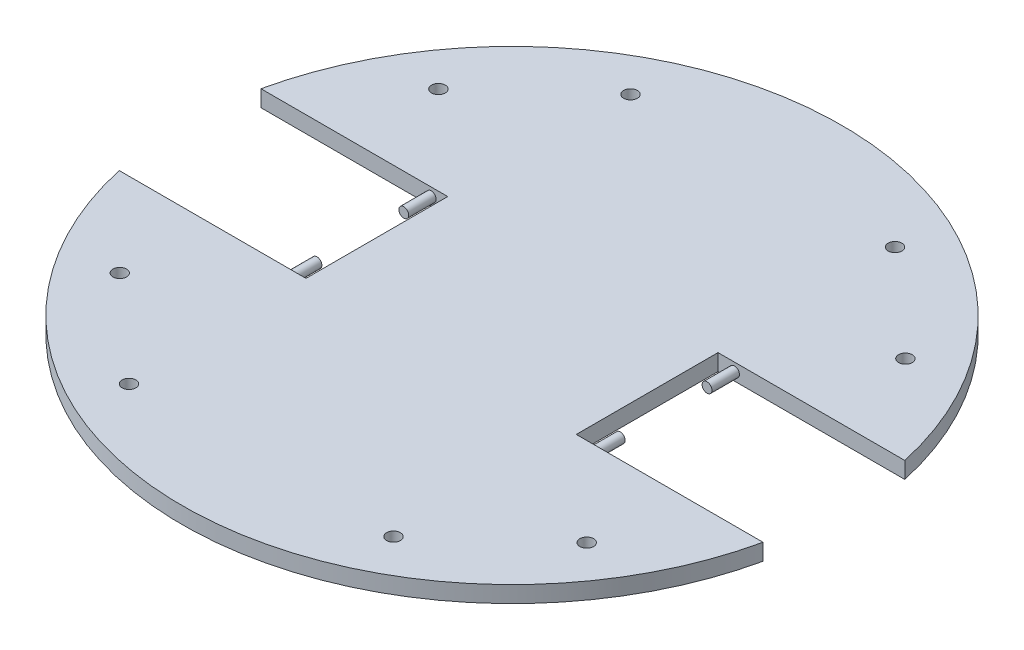
ISO-10303-21;
HEADER;
FILE_DESCRIPTION(('STEP AP214'),'2;1');
FILE_NAME('part.step','',(''),(''),'','','');
FILE_SCHEMA(('AUTOMOTIVE_DESIGN { 1 0 10303 214 1 1 1 1 }'));
ENDSEC;
DATA;
#1=APPLICATION_CONTEXT('core data for automotive mechanical design processes');
#2=APPLICATION_PROTOCOL_DEFINITION('international standard','automotive_design',2000,#1);
#3=PRODUCT_CONTEXT('',#1,'mechanical');
#4=PRODUCT('Part','Part','',(#3));
#5=PRODUCT_RELATED_PRODUCT_CATEGORY('part','',(#4));
#6=PRODUCT_DEFINITION_FORMATION('','',#4);
#7=PRODUCT_DEFINITION_CONTEXT('part definition',#1,'design');
#8=PRODUCT_DEFINITION('design','',#6,#7);
#9=PRODUCT_DEFINITION_SHAPE('','',#8);
#10=(LENGTH_UNIT() NAMED_UNIT(*) SI_UNIT(.MILLI.,.METRE.));
#11=(NAMED_UNIT(*) PLANE_ANGLE_UNIT() SI_UNIT($,.RADIAN.));
#12=(NAMED_UNIT(*) SI_UNIT($,.STERADIAN.) SOLID_ANGLE_UNIT());
#13=UNCERTAINTY_MEASURE_WITH_UNIT(LENGTH_MEASURE(1.E-05),#10,'distance_accuracy_value','');
#14=(GEOMETRIC_REPRESENTATION_CONTEXT(3) GLOBAL_UNCERTAINTY_ASSIGNED_CONTEXT((#13)) GLOBAL_UNIT_ASSIGNED_CONTEXT((#10,
#11,#12)) REPRESENTATION_CONTEXT('',''));
#15=CARTESIAN_POINT('',(0.,0.,0.));
#16=DIRECTION('',(0.,0.,1.));
#17=DIRECTION('',(1.,0.,0.));
#18=AXIS2_PLACEMENT_3D('',#15,#16,#17);
#19=CARTESIAN_POINT('',(0.,3.,0.));
#20=DIRECTION('',(0.,-1.,0.));
#21=DIRECTION('',(0.,0.,-1.));
#22=AXIS2_PLACEMENT_3D('',#19,#20,#21);
#23=CYLINDRICAL_SURFACE('',#22,60.);
#24=DIRECTION('',(0.,1.,0.));
#25=VECTOR('',#24,1.);
#26=CARTESIAN_POINT('',(-58.5968429183689,0.,12.9));
#27=LINE('',#26,#25);
#28=CARTESIAN_POINT('',(-58.5968429183689,0.,12.9));
#29=VERTEX_POINT('',#28);
#30=CARTESIAN_POINT('',(-58.5968429183689,3.,12.9));
#31=VERTEX_POINT('',#30);
#32=EDGE_CURVE('E135',#29,#31,#27,.T.);
#33=ORIENTED_EDGE('',*,*,#32,.F.);
#34=CARTESIAN_POINT('',(0.,0.,0.));
#35=DIRECTION('',(0.,1.,0.));
#36=DIRECTION('',(0.,0.,1.));
#37=AXIS2_PLACEMENT_3D('',#34,#35,#36);
#38=CIRCLE('',#37,60.);
#39=CARTESIAN_POINT('',(58.5968429183689,0.,12.9));
#40=VERTEX_POINT('',#39);
#41=EDGE_CURVE('E205',#29,#40,#38,.T.);
#42=ORIENTED_EDGE('',*,*,#41,.T.);
#43=DIRECTION('',(0.,1.,0.));
#44=VECTOR('',#43,1.);
#45=CARTESIAN_POINT('',(58.5968429183689,0.,12.9));
#46=LINE('',#45,#44);
#47=CARTESIAN_POINT('',(58.5968429183689,3.,12.9));
#48=VERTEX_POINT('',#47);
#49=EDGE_CURVE('E56',#40,#48,#46,.T.);
#50=ORIENTED_EDGE('',*,*,#49,.T.);
#51=CARTESIAN_POINT('',(0.,3.,0.));
#52=DIRECTION('',(0.,1.,0.));
#53=DIRECTION('',(0.,0.,1.));
#54=AXIS2_PLACEMENT_3D('',#51,#52,#53);
#55=CIRCLE('',#54,60.);
#56=EDGE_CURVE('E208',#31,#48,#55,.T.);
#57=ORIENTED_EDGE('',*,*,#56,.F.);
#58=EDGE_LOOP('',(#33,#42,#50,#57));
#59=FACE_BOUND('',#58,.T.);
#60=ADVANCED_FACE('F34',(#59),#23,.T.);
#61=CARTESIAN_POINT('',(58.5968429183689,0.,-12.9));
#62=VERTEX_POINT('',#61);
#63=CARTESIAN_POINT('',(-58.5968429183689,0.,-12.9));
#64=VERTEX_POINT('',#63);
#65=EDGE_CURVE('E212',#62,#64,#38,.T.);
#66=ORIENTED_EDGE('',*,*,#65,.T.);
#67=DIRECTION('',(0.,1.,0.));
#68=VECTOR('',#67,1.);
#69=CARTESIAN_POINT('',(-58.5968429183689,0.,-12.9));
#70=LINE('',#69,#68);
#71=CARTESIAN_POINT('',(-58.5968429183689,3.,-12.9));
#72=VERTEX_POINT('',#71);
#73=EDGE_CURVE('E48',#64,#72,#70,.T.);
#74=ORIENTED_EDGE('',*,*,#73,.T.);
#75=CARTESIAN_POINT('',(58.5968429183689,3.,-12.9));
#76=VERTEX_POINT('',#75);
#77=EDGE_CURVE('E211',#76,#72,#55,.T.);
#78=ORIENTED_EDGE('',*,*,#77,.F.);
#79=DIRECTION('',(0.,1.,0.));
#80=VECTOR('',#79,1.);
#81=CARTESIAN_POINT('',(58.5968429183689,0.,-12.9));
#82=LINE('',#81,#80);
#83=EDGE_CURVE('E156',#62,#76,#82,.T.);
#84=ORIENTED_EDGE('',*,*,#83,.F.);
#85=EDGE_LOOP('',(#66,#74,#78,#84));
#86=FACE_BOUND('',#85,.T.);
#87=ADVANCED_FACE('F225',(#86),#23,.T.);
#88=CARTESIAN_POINT('',(0.,3.,0.));
#89=DIRECTION('',(0.,1.,0.));
#90=DIRECTION('',(0.,0.,1.));
#91=AXIS2_PLACEMENT_3D('',#88,#89,#90);
#92=PLANE('',#91);
#93=CARTESIAN_POINT('',(42.6064496423327,3.,-29.0020858945053));
#94=DIRECTION('',(0.,1.,0.));
#95=DIRECTION('',(0.,0.,1.));
#96=AXIS2_PLACEMENT_3D('',#93,#94,#95);
#97=CIRCLE('',#96,1.25);
#98=CARTESIAN_POINT('',(42.6064496423327,3.,-27.7520858945053));
#99=VERTEX_POINT('',#98);
#100=EDGE_CURVE('E182',#99,#99,#97,.T.);
#101=ORIENTED_EDGE('',*,*,#100,.F.);
#102=EDGE_LOOP('',(#101));
#103=FACE_BOUND('',#102,.T.);
#104=CARTESIAN_POINT('',(42.6064496423327,3.,29.0020858945053));
#105=DIRECTION('',(0.,1.,0.));
#106=DIRECTION('',(0.,0.,-1.));
#107=AXIS2_PLACEMENT_3D('',#104,#105,#106);
#108=CIRCLE('',#107,1.25);
#109=CARTESIAN_POINT('',(42.6064496423327,3.,27.7520858945053));
#110=VERTEX_POINT('',#109);
#111=EDGE_CURVE('E188',#110,#110,#108,.T.);
#112=ORIENTED_EDGE('',*,*,#111,.F.);
#113=EDGE_LOOP('',(#112));
#114=FACE_BOUND('',#113,.T.);
#115=CARTESIAN_POINT('',(-42.3935503576673,3.,29.0020858945053));
#116=DIRECTION('',(0.,1.,0.));
#117=DIRECTION('',(0.,0.,-1.));
#118=AXIS2_PLACEMENT_3D('',#115,#116,#117);
#119=CIRCLE('',#118,1.25);
#120=CARTESIAN_POINT('',(-42.3935503576673,3.,27.7520858945053));
#121=VERTEX_POINT('',#120);
#122=EDGE_CURVE('E194',#121,#121,#119,.T.);
#123=ORIENTED_EDGE('',*,*,#122,.F.);
#124=EDGE_LOOP('',(#123));
#125=FACE_BOUND('',#124,.T.);
#126=CARTESIAN_POINT('',(-24.0731025072115,3.,-45.6446312019142));
#127=DIRECTION('',(0.,1.,0.));
#128=DIRECTION('',(0.,0.,1.));
#129=AXIS2_PLACEMENT_3D('',#126,#127,#128);
#130=CIRCLE('',#129,1.25);
#131=CARTESIAN_POINT('',(-24.0731025072115,3.,-44.3946312019142));
#132=VERTEX_POINT('',#131);
#133=EDGE_CURVE('E163',#132,#132,#130,.T.);
#134=ORIENTED_EDGE('',*,*,#133,.F.);
#135=EDGE_LOOP('',(#134));
#136=FACE_BOUND('',#135,.T.);
#137=CARTESIAN_POINT('',(24.0731025072115,3.,-45.6446312019142));
#138=DIRECTION('',(0.,1.,0.));
#139=DIRECTION('',(0.,0.,-1.));
#140=AXIS2_PLACEMENT_3D('',#137,#138,#139);
#141=CIRCLE('',#140,1.25);
#142=CARTESIAN_POINT('',(24.0731025072115,3.,-46.8946312019142));
#143=VERTEX_POINT('',#142);
#144=EDGE_CURVE('E164',#143,#143,#141,.T.);
#145=ORIENTED_EDGE('',*,*,#144,.F.);
#146=EDGE_LOOP('',(#145));
#147=FACE_BOUND('',#146,.T.);
#148=CARTESIAN_POINT('',(24.0731025072115,3.,45.6446312019142));
#149=DIRECTION('',(0.,1.,0.));
#150=DIRECTION('',(0.,0.,1.));
#151=AXIS2_PLACEMENT_3D('',#148,#149,#150);
#152=CIRCLE('',#151,1.25);
#153=CARTESIAN_POINT('',(24.0731025072115,3.,46.8946312019142));
#154=VERTEX_POINT('',#153);
#155=EDGE_CURVE('E170',#154,#154,#152,.T.);
#156=ORIENTED_EDGE('',*,*,#155,.F.);
#157=EDGE_LOOP('',(#156));
#158=FACE_BOUND('',#157,.T.);
#159=CARTESIAN_POINT('',(-24.0731025072115,3.,45.6446312019142));
#160=DIRECTION('',(0.,1.,0.));
#161=DIRECTION('',(0.,0.,-1.));
#162=AXIS2_PLACEMENT_3D('',#159,#160,#161);
#163=CIRCLE('',#162,1.25);
#164=CARTESIAN_POINT('',(-24.0731025072115,3.,44.3946312019142));
#165=VERTEX_POINT('',#164);
#166=EDGE_CURVE('E134',#165,#165,#163,.T.);
#167=ORIENTED_EDGE('',*,*,#166,.F.);
#168=EDGE_LOOP('',(#167));
#169=FACE_BOUND('',#168,.T.);
#170=CARTESIAN_POINT('',(-42.3935503576673,3.,-29.0020858945053));
#171=DIRECTION('',(0.,1.,0.));
#172=DIRECTION('',(0.,0.,1.));
#173=AXIS2_PLACEMENT_3D('',#170,#171,#172);
#174=CIRCLE('',#173,1.25);
#175=CARTESIAN_POINT('',(-42.3935503576673,3.,-27.7520858945053));
#176=VERTEX_POINT('',#175);
#177=EDGE_CURVE('E181',#176,#176,#174,.T.);
#178=ORIENTED_EDGE('',*,*,#177,.F.);
#179=EDGE_LOOP('',(#178));
#180=FACE_BOUND('',#179,.T.);
#181=DIRECTION('',(0.,0.,1.));
#182=VECTOR('',#181,1.);
#183=CARTESIAN_POINT('',(-24.6,3.,0.));
#184=LINE('',#183,#182);
#185=CARTESIAN_POINT('',(-24.6,3.,-12.9));
#186=VERTEX_POINT('',#185);
#187=CARTESIAN_POINT('',(-24.6,3.,12.9));
#188=VERTEX_POINT('',#187);
#189=EDGE_CURVE('E106',#186,#188,#184,.T.);
#190=ORIENTED_EDGE('',*,*,#189,.T.);
#191=DIRECTION('',(-1.,0.,0.));
#192=VECTOR('',#191,1.);
#193=CARTESIAN_POINT('',(0.,3.,12.9));
#194=LINE('',#193,#192);
#195=EDGE_CURVE('E119',#188,#31,#194,.T.);
#196=ORIENTED_EDGE('',*,*,#195,.T.);
#197=ORIENTED_EDGE('',*,*,#56,.T.);
#198=DIRECTION('',(1.,0.,0.));
#199=VECTOR('',#198,1.);
#200=CARTESIAN_POINT('',(0.,3.,12.9));
#201=LINE('',#200,#199);
#202=CARTESIAN_POINT('',(24.6,3.,12.9));
#203=VERTEX_POINT('',#202);
#204=EDGE_CURVE('E150',#203,#48,#201,.T.);
#205=ORIENTED_EDGE('',*,*,#204,.F.);
#206=DIRECTION('',(0.,0.,1.));
#207=VECTOR('',#206,1.);
#208=CARTESIAN_POINT('',(24.6,3.,0.));
#209=LINE('',#208,#207);
#210=CARTESIAN_POINT('',(24.6,3.,-12.9));
#211=VERTEX_POINT('',#210);
#212=EDGE_CURVE('E147',#211,#203,#209,.T.);
#213=ORIENTED_EDGE('',*,*,#212,.F.);
#214=DIRECTION('',(1.,0.,0.));
#215=VECTOR('',#214,1.);
#216=CARTESIAN_POINT('',(0.,3.,-12.9));
#217=LINE('',#216,#215);
#218=EDGE_CURVE('E142',#211,#76,#217,.T.);
#219=ORIENTED_EDGE('',*,*,#218,.T.);
#220=ORIENTED_EDGE('',*,*,#77,.T.);
#221=DIRECTION('',(-1.,0.,0.));
#222=VECTOR('',#221,1.);
#223=CARTESIAN_POINT('',(0.,3.,-12.9));
#224=LINE('',#223,#222);
#225=EDGE_CURVE('E122',#186,#72,#224,.T.);
#226=ORIENTED_EDGE('',*,*,#225,.F.);
#227=EDGE_LOOP('',(#190,#196,#197,#205,#213,#219,#220,#226));
#228=FACE_BOUND('',#227,.T.);
#229=ADVANCED_FACE('F220',(#103,#114,#125,#136,#147,#158,#169,#180,#228),#92,.T.);
#230=CARTESIAN_POINT('',(0.,0.,0.));
#231=DIRECTION('',(0.,1.,0.));
#232=DIRECTION('',(0.,0.,1.));
#233=AXIS2_PLACEMENT_3D('',#230,#231,#232);
#234=PLANE('',#233);
#235=CARTESIAN_POINT('',(42.6064496423327,0.,-29.0020858945053));
#236=DIRECTION('',(0.,1.,0.));
#237=DIRECTION('',(0.,0.,1.));
#238=AXIS2_PLACEMENT_3D('',#235,#236,#237);
#239=CIRCLE('',#238,1.25);
#240=CARTESIAN_POINT('',(42.6064496423327,0.,-27.7520858945053));
#241=VERTEX_POINT('',#240);
#242=EDGE_CURVE('E178',#241,#241,#239,.T.);
#243=ORIENTED_EDGE('',*,*,#242,.T.);
#244=EDGE_LOOP('',(#243));
#245=FACE_BOUND('',#244,.T.);
#246=CARTESIAN_POINT('',(42.6064496423327,0.,29.0020858945053));
#247=DIRECTION('',(0.,1.,0.));
#248=DIRECTION('',(0.,0.,-1.));
#249=AXIS2_PLACEMENT_3D('',#246,#247,#248);
#250=CIRCLE('',#249,1.25);
#251=CARTESIAN_POINT('',(42.6064496423327,0.,27.7520858945053));
#252=VERTEX_POINT('',#251);
#253=EDGE_CURVE('E185',#252,#252,#250,.T.);
#254=ORIENTED_EDGE('',*,*,#253,.T.);
#255=EDGE_LOOP('',(#254));
#256=FACE_BOUND('',#255,.T.);
#257=CARTESIAN_POINT('',(-42.3935503576673,0.,29.0020858945053));
#258=DIRECTION('',(0.,1.,0.));
#259=DIRECTION('',(0.,0.,-1.));
#260=AXIS2_PLACEMENT_3D('',#257,#258,#259);
#261=CIRCLE('',#260,1.25);
#262=CARTESIAN_POINT('',(-42.3935503576673,0.,27.7520858945053));
#263=VERTEX_POINT('',#262);
#264=EDGE_CURVE('E191',#263,#263,#261,.T.);
#265=ORIENTED_EDGE('',*,*,#264,.T.);
#266=EDGE_LOOP('',(#265));
#267=FACE_BOUND('',#266,.T.);
#268=CARTESIAN_POINT('',(-24.0731025072115,0.,-45.6446312019142));
#269=DIRECTION('',(0.,1.,0.));
#270=DIRECTION('',(0.,0.,1.));
#271=AXIS2_PLACEMENT_3D('',#268,#269,#270);
#272=CIRCLE('',#271,1.25);
#273=CARTESIAN_POINT('',(-24.0731025072115,0.,-44.3946312019142));
#274=VERTEX_POINT('',#273);
#275=EDGE_CURVE('E197',#274,#274,#272,.T.);
#276=ORIENTED_EDGE('',*,*,#275,.T.);
#277=EDGE_LOOP('',(#276));
#278=FACE_BOUND('',#277,.T.);
#279=CARTESIAN_POINT('',(24.0731025072115,0.,-45.6446312019142));
#280=DIRECTION('',(0.,1.,0.));
#281=DIRECTION('',(0.,0.,-1.));
#282=AXIS2_PLACEMENT_3D('',#279,#280,#281);
#283=CIRCLE('',#282,1.25);
#284=CARTESIAN_POINT('',(24.0731025072115,0.,-46.8946312019142));
#285=VERTEX_POINT('',#284);
#286=EDGE_CURVE('E160',#285,#285,#283,.T.);
#287=ORIENTED_EDGE('',*,*,#286,.T.);
#288=EDGE_LOOP('',(#287));
#289=FACE_BOUND('',#288,.T.);
#290=CARTESIAN_POINT('',(24.0731025072115,0.,45.6446312019142));
#291=DIRECTION('',(0.,1.,0.));
#292=DIRECTION('',(0.,0.,1.));
#293=AXIS2_PLACEMENT_3D('',#290,#291,#292);
#294=CIRCLE('',#293,1.25);
#295=CARTESIAN_POINT('',(24.0731025072115,0.,46.8946312019142));
#296=VERTEX_POINT('',#295);
#297=EDGE_CURVE('E167',#296,#296,#294,.T.);
#298=ORIENTED_EDGE('',*,*,#297,.T.);
#299=EDGE_LOOP('',(#298));
#300=FACE_BOUND('',#299,.T.);
#301=CARTESIAN_POINT('',(-24.0731025072115,0.,45.6446312019142));
#302=DIRECTION('',(0.,1.,0.));
#303=DIRECTION('',(0.,0.,-1.));
#304=AXIS2_PLACEMENT_3D('',#301,#302,#303);
#305=CIRCLE('',#304,1.25);
#306=CARTESIAN_POINT('',(-24.0731025072115,0.,44.3946312019142));
#307=VERTEX_POINT('',#306);
#308=EDGE_CURVE('E173',#307,#307,#305,.T.);
#309=ORIENTED_EDGE('',*,*,#308,.T.);
#310=EDGE_LOOP('',(#309));
#311=FACE_BOUND('',#310,.T.);
#312=CARTESIAN_POINT('',(-42.3935503576673,0.,-29.0020858945053));
#313=DIRECTION('',(0.,1.,0.));
#314=DIRECTION('',(0.,0.,1.));
#315=AXIS2_PLACEMENT_3D('',#312,#313,#314);
#316=CIRCLE('',#315,1.25);
#317=CARTESIAN_POINT('',(-42.3935503576673,0.,-27.7520858945053));
#318=VERTEX_POINT('',#317);
#319=EDGE_CURVE('E202',#318,#318,#316,.T.);
#320=ORIENTED_EDGE('',*,*,#319,.T.);
#321=EDGE_LOOP('',(#320));
#322=FACE_BOUND('',#321,.T.);
#323=DIRECTION('',(-1.,0.,0.));
#324=VECTOR('',#323,1.);
#325=CARTESIAN_POINT('',(0.,0.,12.9));
#326=LINE('',#325,#324);
#327=CARTESIAN_POINT('',(-24.6,0.,12.9));
#328=VERTEX_POINT('',#327);
#329=EDGE_CURVE('E108',#328,#29,#326,.T.);
#330=ORIENTED_EDGE('',*,*,#329,.F.);
#331=DIRECTION('',(0.,0.,1.));
#332=VECTOR('',#331,1.);
#333=CARTESIAN_POINT('',(-24.6,0.,0.));
#334=LINE('',#333,#332);
#335=CARTESIAN_POINT('',(-24.6,0.,-12.9));
#336=VERTEX_POINT('',#335);
#337=EDGE_CURVE('E103',#336,#328,#334,.T.);
#338=ORIENTED_EDGE('',*,*,#337,.F.);
#339=DIRECTION('',(-1.,0.,0.));
#340=VECTOR('',#339,1.);
#341=CARTESIAN_POINT('',(0.,0.,-12.9));
#342=LINE('',#341,#340);
#343=EDGE_CURVE('E110',#336,#64,#342,.T.);
#344=ORIENTED_EDGE('',*,*,#343,.T.);
#345=ORIENTED_EDGE('',*,*,#65,.F.);
#346=DIRECTION('',(1.,0.,0.));
#347=VECTOR('',#346,1.);
#348=CARTESIAN_POINT('',(0.,0.,-12.9));
#349=LINE('',#348,#347);
#350=CARTESIAN_POINT('',(24.6,0.,-12.9));
#351=VERTEX_POINT('',#350);
#352=EDGE_CURVE('E144',#351,#62,#349,.T.);
#353=ORIENTED_EDGE('',*,*,#352,.F.);
#354=DIRECTION('',(0.,0.,1.));
#355=VECTOR('',#354,1.);
#356=CARTESIAN_POINT('',(24.6,0.,0.));
#357=LINE('',#356,#355);
#358=CARTESIAN_POINT('',(24.6,0.,12.9));
#359=VERTEX_POINT('',#358);
#360=EDGE_CURVE('E138',#351,#359,#357,.T.);
#361=ORIENTED_EDGE('',*,*,#360,.T.);
#362=DIRECTION('',(1.,0.,0.));
#363=VECTOR('',#362,1.);
#364=CARTESIAN_POINT('',(0.,0.,12.9));
#365=LINE('',#364,#363);
#366=EDGE_CURVE('E141',#359,#40,#365,.T.);
#367=ORIENTED_EDGE('',*,*,#366,.T.);
#368=ORIENTED_EDGE('',*,*,#41,.F.);
#369=EDGE_LOOP('',(#330,#338,#344,#345,#353,#361,#367,#368));
#370=FACE_BOUND('',#369,.T.);
#371=ADVANCED_FACE('F117',(#245,#256,#267,#278,#289,#300,#311,#322,#370),#234,.F.);
#372=CARTESIAN_POINT('',(-42.3935503576673,0.,-29.0020858945053));
#373=DIRECTION('',(0.,1.,0.));
#374=DIRECTION('',(0.,0.,1.));
#375=AXIS2_PLACEMENT_3D('',#372,#373,#374);
#376=CYLINDRICAL_SURFACE('',#375,1.25);
#377=ORIENTED_EDGE('',*,*,#319,.F.);
#378=EDGE_LOOP('',(#377));
#379=FACE_BOUND('',#378,.T.);
#380=ORIENTED_EDGE('',*,*,#177,.T.);
#381=EDGE_LOOP('',(#380));
#382=FACE_BOUND('',#381,.T.);
#383=ADVANCED_FACE('F264',(#379,#382),#376,.F.);
#384=CARTESIAN_POINT('',(-24.0731025072115,0.,45.6446312019142));
#385=DIRECTION('',(0.,1.,0.));
#386=DIRECTION('',(0.,0.,1.));
#387=AXIS2_PLACEMENT_3D('',#384,#385,#386);
#388=CYLINDRICAL_SURFACE('',#387,1.25);
#389=ORIENTED_EDGE('',*,*,#308,.F.);
#390=EDGE_LOOP('',(#389));
#391=FACE_BOUND('',#390,.T.);
#392=ORIENTED_EDGE('',*,*,#166,.T.);
#393=EDGE_LOOP('',(#392));
#394=FACE_BOUND('',#393,.T.);
#395=ADVANCED_FACE('F271',(#391,#394),#388,.F.);
#396=CARTESIAN_POINT('',(24.0731025072115,0.,45.6446312019142));
#397=DIRECTION('',(0.,1.,0.));
#398=DIRECTION('',(0.,0.,1.));
#399=AXIS2_PLACEMENT_3D('',#396,#397,#398);
#400=CYLINDRICAL_SURFACE('',#399,1.25);
#401=ORIENTED_EDGE('',*,*,#297,.F.);
#402=EDGE_LOOP('',(#401));
#403=FACE_BOUND('',#402,.T.);
#404=ORIENTED_EDGE('',*,*,#155,.T.);
#405=EDGE_LOOP('',(#404));
#406=FACE_BOUND('',#405,.T.);
#407=ADVANCED_FACE('F292',(#403,#406),#400,.F.);
#408=CARTESIAN_POINT('',(24.0731025072115,0.,-45.6446312019142));
#409=DIRECTION('',(0.,1.,0.));
#410=DIRECTION('',(0.,0.,1.));
#411=AXIS2_PLACEMENT_3D('',#408,#409,#410);
#412=CYLINDRICAL_SURFACE('',#411,1.25);
#413=ORIENTED_EDGE('',*,*,#286,.F.);
#414=EDGE_LOOP('',(#413));
#415=FACE_BOUND('',#414,.T.);
#416=ORIENTED_EDGE('',*,*,#144,.T.);
#417=EDGE_LOOP('',(#416));
#418=FACE_BOUND('',#417,.T.);
#419=ADVANCED_FACE('F277',(#415,#418),#412,.F.);
#420=CARTESIAN_POINT('',(-24.0731025072115,0.,-45.6446312019142));
#421=DIRECTION('',(0.,1.,0.));
#422=DIRECTION('',(0.,0.,1.));
#423=AXIS2_PLACEMENT_3D('',#420,#421,#422);
#424=CYLINDRICAL_SURFACE('',#423,1.25);
#425=ORIENTED_EDGE('',*,*,#275,.F.);
#426=EDGE_LOOP('',(#425));
#427=FACE_BOUND('',#426,.T.);
#428=ORIENTED_EDGE('',*,*,#133,.T.);
#429=EDGE_LOOP('',(#428));
#430=FACE_BOUND('',#429,.T.);
#431=ADVANCED_FACE('F273',(#427,#430),#424,.F.);
#432=CARTESIAN_POINT('',(-42.3935503576673,0.,29.0020858945053));
#433=DIRECTION('',(0.,1.,0.));
#434=DIRECTION('',(0.,0.,1.));
#435=AXIS2_PLACEMENT_3D('',#432,#433,#434);
#436=CYLINDRICAL_SURFACE('',#435,1.25);
#437=ORIENTED_EDGE('',*,*,#264,.F.);
#438=EDGE_LOOP('',(#437));
#439=FACE_BOUND('',#438,.T.);
#440=ORIENTED_EDGE('',*,*,#122,.T.);
#441=EDGE_LOOP('',(#440));
#442=FACE_BOUND('',#441,.T.);
#443=ADVANCED_FACE('F276',(#439,#442),#436,.F.);
#444=CARTESIAN_POINT('',(42.6064496423327,0.,29.0020858945053));
#445=DIRECTION('',(0.,1.,0.));
#446=DIRECTION('',(0.,0.,1.));
#447=AXIS2_PLACEMENT_3D('',#444,#445,#446);
#448=CYLINDRICAL_SURFACE('',#447,1.25);
#449=ORIENTED_EDGE('',*,*,#253,.F.);
#450=EDGE_LOOP('',(#449));
#451=FACE_BOUND('',#450,.T.);
#452=ORIENTED_EDGE('',*,*,#111,.T.);
#453=EDGE_LOOP('',(#452));
#454=FACE_BOUND('',#453,.T.);
#455=ADVANCED_FACE('F281',(#451,#454),#448,.F.);
#456=CARTESIAN_POINT('',(42.6064496423327,0.,-29.0020858945053));
#457=DIRECTION('',(0.,1.,0.));
#458=DIRECTION('',(0.,0.,1.));
#459=AXIS2_PLACEMENT_3D('',#456,#457,#458);
#460=CYLINDRICAL_SURFACE('',#459,1.25);
#461=ORIENTED_EDGE('',*,*,#242,.F.);
#462=EDGE_LOOP('',(#461));
#463=FACE_BOUND('',#462,.T.);
#464=ORIENTED_EDGE('',*,*,#100,.T.);
#465=EDGE_LOOP('',(#464));
#466=FACE_BOUND('',#465,.T.);
#467=ADVANCED_FACE('F285',(#463,#466),#460,.F.);
#468=CARTESIAN_POINT('',(24.6,0.,0.));
#469=DIRECTION('',(-1.,0.,0.));
#470=DIRECTION('',(0.,0.,1.));
#471=AXIS2_PLACEMENT_3D('',#468,#469,#470);
#472=PLANE('',#471);
#473=ORIENTED_EDGE('',*,*,#212,.T.);
#474=DIRECTION('',(0.,1.,0.));
#475=VECTOR('',#474,1.);
#476=CARTESIAN_POINT('',(24.6,0.,12.9));
#477=LINE('',#476,#475);
#478=EDGE_CURVE('E146',#359,#203,#477,.T.);
#479=ORIENTED_EDGE('',*,*,#478,.F.);
#480=ORIENTED_EDGE('',*,*,#360,.F.);
#481=DIRECTION('',(0.,1.,0.));
#482=VECTOR('',#481,1.);
#483=CARTESIAN_POINT('',(24.6,0.,-12.9));
#484=LINE('',#483,#482);
#485=EDGE_CURVE('E130',#351,#211,#484,.T.);
#486=ORIENTED_EDGE('',*,*,#485,.T.);
#487=EDGE_LOOP('',(#473,#479,#480,#486));
#488=FACE_BOUND('',#487,.T.);
#489=ADVANCED_FACE('F231',(#488),#472,.F.);
#490=CARTESIAN_POINT('',(0.,0.,-12.9));
#491=DIRECTION('',(0.,0.,1.));
#492=DIRECTION('',(1.,0.,0.));
#493=AXIS2_PLACEMENT_3D('',#490,#491,#492);
#494=PLANE('',#493);
#495=CARTESIAN_POINT('',(27.6,1.5,-12.9));
#496=DIRECTION('',(0.,0.,1.));
#497=DIRECTION('',(1.,0.,0.));
#498=AXIS2_PLACEMENT_3D('',#495,#496,#497);
#499=CIRCLE('',#498,0.9);
#500=CARTESIAN_POINT('',(28.5,1.5,-12.9));
#501=VERTEX_POINT('',#500);
#502=EDGE_CURVE('E125',#501,#501,#499,.T.);
#503=ORIENTED_EDGE('',*,*,#502,.F.);
#504=EDGE_LOOP('',(#503));
#505=FACE_BOUND('',#504,.T.);
#506=ORIENTED_EDGE('',*,*,#218,.F.);
#507=ORIENTED_EDGE('',*,*,#485,.F.);
#508=ORIENTED_EDGE('',*,*,#352,.T.);
#509=ORIENTED_EDGE('',*,*,#83,.T.);
#510=EDGE_LOOP('',(#506,#507,#508,#509));
#511=FACE_BOUND('',#510,.T.);
#512=ADVANCED_FACE('F229',(#505,#511),#494,.T.);
#513=CARTESIAN_POINT('',(0.,0.,12.9));
#514=DIRECTION('',(0.,0.,1.));
#515=DIRECTION('',(1.,0.,0.));
#516=AXIS2_PLACEMENT_3D('',#513,#514,#515);
#517=PLANE('',#516);
#518=CARTESIAN_POINT('',(27.6,1.5,12.9));
#519=DIRECTION('',(0.,0.,1.));
#520=DIRECTION('',(1.,0.,0.));
#521=AXIS2_PLACEMENT_3D('',#518,#519,#520);
#522=CIRCLE('',#521,0.9);
#523=CARTESIAN_POINT('',(28.5,1.5,12.9));
#524=VERTEX_POINT('',#523);
#525=EDGE_CURVE('E41',#524,#524,#522,.F.);
#526=ORIENTED_EDGE('',*,*,#525,.F.);
#527=EDGE_LOOP('',(#526));
#528=FACE_BOUND('',#527,.T.);
#529=ORIENTED_EDGE('',*,*,#204,.T.);
#530=ORIENTED_EDGE('',*,*,#49,.F.);
#531=ORIENTED_EDGE('',*,*,#366,.F.);
#532=ORIENTED_EDGE('',*,*,#478,.T.);
#533=EDGE_LOOP('',(#529,#530,#531,#532));
#534=FACE_BOUND('',#533,.T.);
#535=ADVANCED_FACE('F233',(#528,#534),#517,.F.);
#536=CARTESIAN_POINT('',(-24.6,0.,0.));
#537=DIRECTION('',(-1.,0.,0.));
#538=DIRECTION('',(0.,0.,1.));
#539=AXIS2_PLACEMENT_3D('',#536,#537,#538);
#540=PLANE('',#539);
#541=ORIENTED_EDGE('',*,*,#189,.F.);
#542=DIRECTION('',(0.,1.,0.));
#543=VECTOR('',#542,1.);
#544=CARTESIAN_POINT('',(-24.6,0.,-12.9));
#545=LINE('',#544,#543);
#546=EDGE_CURVE('E99',#336,#186,#545,.T.);
#547=ORIENTED_EDGE('',*,*,#546,.F.);
#548=ORIENTED_EDGE('',*,*,#337,.T.);
#549=DIRECTION('',(0.,1.,0.));
#550=VECTOR('',#549,1.);
#551=CARTESIAN_POINT('',(-24.6,0.,12.9));
#552=LINE('',#551,#550);
#553=EDGE_CURVE('E132',#328,#188,#552,.T.);
#554=ORIENTED_EDGE('',*,*,#553,.T.);
#555=EDGE_LOOP('',(#541,#547,#548,#554));
#556=FACE_BOUND('',#555,.T.);
#557=ADVANCED_FACE('F100',(#556),#540,.T.);
#558=CARTESIAN_POINT('',(0.,0.,12.9));
#559=DIRECTION('',(0.,0.,-1.));
#560=DIRECTION('',(-1.,0.,0.));
#561=AXIS2_PLACEMENT_3D('',#558,#559,#560);
#562=PLANE('',#561);
#563=CARTESIAN_POINT('',(-27.6,1.5,12.9));
#564=DIRECTION('',(0.,0.,-1.));
#565=DIRECTION('',(-1.,0.,0.));
#566=AXIS2_PLACEMENT_3D('',#563,#564,#565);
#567=CIRCLE('',#566,0.9);
#568=CARTESIAN_POINT('',(-28.5,1.5,12.9));
#569=VERTEX_POINT('',#568);
#570=EDGE_CURVE('E323',#569,#569,#567,.T.);
#571=ORIENTED_EDGE('',*,*,#570,.F.);
#572=EDGE_LOOP('',(#571));
#573=FACE_BOUND('',#572,.T.);
#574=ORIENTED_EDGE('',*,*,#195,.F.);
#575=ORIENTED_EDGE('',*,*,#553,.F.);
#576=ORIENTED_EDGE('',*,*,#329,.T.);
#577=ORIENTED_EDGE('',*,*,#32,.T.);
#578=EDGE_LOOP('',(#574,#575,#576,#577));
#579=FACE_BOUND('',#578,.T.);
#580=ADVANCED_FACE('F238',(#573,#579),#562,.T.);
#581=CARTESIAN_POINT('',(0.,0.,-12.9));
#582=DIRECTION('',(0.,0.,-1.));
#583=DIRECTION('',(-1.,0.,0.));
#584=AXIS2_PLACEMENT_3D('',#581,#582,#583);
#585=PLANE('',#584);
#586=CARTESIAN_POINT('',(-27.6,1.5,-12.9));
#587=DIRECTION('',(0.,0.,-1.));
#588=DIRECTION('',(-1.,0.,0.));
#589=AXIS2_PLACEMENT_3D('',#586,#587,#588);
#590=CIRCLE('',#589,0.9);
#591=CARTESIAN_POINT('',(-28.5,1.5,-12.9));
#592=VERTEX_POINT('',#591);
#593=EDGE_CURVE('E11',#592,#592,#590,.F.);
#594=ORIENTED_EDGE('',*,*,#593,.F.);
#595=EDGE_LOOP('',(#594));
#596=FACE_BOUND('',#595,.T.);
#597=ORIENTED_EDGE('',*,*,#225,.T.);
#598=ORIENTED_EDGE('',*,*,#73,.F.);
#599=ORIENTED_EDGE('',*,*,#343,.F.);
#600=ORIENTED_EDGE('',*,*,#546,.T.);
#601=EDGE_LOOP('',(#597,#598,#599,#600));
#602=FACE_BOUND('',#601,.T.);
#603=ADVANCED_FACE('F111',(#596,#602),#585,.F.);
#604=CARTESIAN_POINT('',(27.6,1.5,-7.9));
#605=DIRECTION('',(0.,0.,-1.));
#606=DIRECTION('',(-1.,0.,0.));
#607=AXIS2_PLACEMENT_3D('',#604,#605,#606);
#608=CYLINDRICAL_SURFACE('',#607,0.9);
#609=CARTESIAN_POINT('',(27.6,1.5,-7.9));
#610=DIRECTION('',(0.,0.,1.));
#611=DIRECTION('',(1.,0.,0.));
#612=AXIS2_PLACEMENT_3D('',#609,#610,#611);
#613=CIRCLE('',#612,0.9);
#614=CARTESIAN_POINT('',(28.5,1.5,-7.9));
#615=VERTEX_POINT('',#614);
#616=EDGE_CURVE('E151',#615,#615,#613,.T.);
#617=ORIENTED_EDGE('',*,*,#616,.F.);
#618=EDGE_LOOP('',(#617));
#619=FACE_BOUND('',#618,.T.);
#620=ORIENTED_EDGE('',*,*,#502,.T.);
#621=EDGE_LOOP('',(#620));
#622=FACE_BOUND('',#621,.T.);
#623=ADVANCED_FACE('F246',(#619,#622),#608,.T.);
#624=CARTESIAN_POINT('',(27.6,1.5,-7.9));
#625=DIRECTION('',(0.,0.,1.));
#626=DIRECTION('',(1.,0.,0.));
#627=AXIS2_PLACEMENT_3D('',#624,#625,#626);
#628=PLANE('',#627);
#629=ORIENTED_EDGE('',*,*,#616,.T.);
#630=EDGE_LOOP('',(#629));
#631=FACE_BOUND('',#630,.T.);
#632=ADVANCED_FACE('F354',(#631),#628,.T.);
#633=CARTESIAN_POINT('',(27.6,1.5,7.9));
#634=DIRECTION('',(0.,0.,1.));
#635=DIRECTION('',(1.,0.,0.));
#636=AXIS2_PLACEMENT_3D('',#633,#634,#635);
#637=CYLINDRICAL_SURFACE('',#636,0.9);
#638=CARTESIAN_POINT('',(27.6,1.5,7.9));
#639=DIRECTION('',(0.,0.,-1.));
#640=DIRECTION('',(-1.,0.,0.));
#641=AXIS2_PLACEMENT_3D('',#638,#639,#640);
#642=CIRCLE('',#641,0.9);
#643=CARTESIAN_POINT('',(26.7,1.5,7.9));
#644=VERTEX_POINT('',#643);
#645=EDGE_CURVE('E312',#644,#644,#642,.T.);
#646=ORIENTED_EDGE('',*,*,#645,.F.);
#647=EDGE_LOOP('',(#646));
#648=FACE_BOUND('',#647,.T.);
#649=ORIENTED_EDGE('',*,*,#525,.T.);
#650=EDGE_LOOP('',(#649));
#651=FACE_BOUND('',#650,.T.);
#652=ADVANCED_FACE('F351',(#648,#651),#637,.T.);
#653=CARTESIAN_POINT('',(27.6,1.5,7.9));
#654=DIRECTION('',(0.,0.,-1.));
#655=DIRECTION('',(-1.,0.,0.));
#656=AXIS2_PLACEMENT_3D('',#653,#654,#655);
#657=PLANE('',#656);
#658=ORIENTED_EDGE('',*,*,#645,.T.);
#659=EDGE_LOOP('',(#658));
#660=FACE_BOUND('',#659,.T.);
#661=ADVANCED_FACE('F347',(#660),#657,.T.);
#662=CARTESIAN_POINT('',(-27.6,1.5,-7.9));
#663=DIRECTION('',(0.,0.,-1.));
#664=DIRECTION('',(-1.,0.,0.));
#665=AXIS2_PLACEMENT_3D('',#662,#663,#664);
#666=CYLINDRICAL_SURFACE('',#665,0.9);
#667=CARTESIAN_POINT('',(-27.6,1.5,-7.9));
#668=DIRECTION('',(0.,0.,1.));
#669=DIRECTION('',(1.,0.,0.));
#670=AXIS2_PLACEMENT_3D('',#667,#668,#669);
#671=CIRCLE('',#670,0.9);
#672=CARTESIAN_POINT('',(-26.7,1.5,-7.9));
#673=VERTEX_POINT('',#672);
#674=EDGE_CURVE('E315',#673,#673,#671,.T.);
#675=ORIENTED_EDGE('',*,*,#674,.F.);
#676=EDGE_LOOP('',(#675));
#677=FACE_BOUND('',#676,.T.);
#678=ORIENTED_EDGE('',*,*,#593,.T.);
#679=EDGE_LOOP('',(#678));
#680=FACE_BOUND('',#679,.T.);
#681=ADVANCED_FACE('F341',(#677,#680),#666,.T.);
#682=CARTESIAN_POINT('',(-27.6,1.5,-7.9));
#683=DIRECTION('',(0.,0.,1.));
#684=DIRECTION('',(1.,0.,0.));
#685=AXIS2_PLACEMENT_3D('',#682,#683,#684);
#686=PLANE('',#685);
#687=ORIENTED_EDGE('',*,*,#674,.T.);
#688=EDGE_LOOP('',(#687));
#689=FACE_BOUND('',#688,.T.);
#690=ADVANCED_FACE('F334',(#689),#686,.T.);
#691=CARTESIAN_POINT('',(-27.6,1.5,7.9));
#692=DIRECTION('',(0.,0.,1.));
#693=DIRECTION('',(1.,0.,0.));
#694=AXIS2_PLACEMENT_3D('',#691,#692,#693);
#695=CYLINDRICAL_SURFACE('',#694,0.9);
#696=CARTESIAN_POINT('',(-27.6,1.5,7.9));
#697=DIRECTION('',(0.,0.,-1.));
#698=DIRECTION('',(-1.,0.,0.));
#699=AXIS2_PLACEMENT_3D('',#696,#697,#698);
#700=CIRCLE('',#699,0.9);
#701=CARTESIAN_POINT('',(-28.5,1.5,7.9));
#702=VERTEX_POINT('',#701);
#703=EDGE_CURVE('E320',#702,#702,#700,.T.);
#704=ORIENTED_EDGE('',*,*,#703,.F.);
#705=EDGE_LOOP('',(#704));
#706=FACE_BOUND('',#705,.T.);
#707=ORIENTED_EDGE('',*,*,#570,.T.);
#708=EDGE_LOOP('',(#707));
#709=FACE_BOUND('',#708,.T.);
#710=ADVANCED_FACE('F331',(#706,#709),#695,.T.);
#711=CARTESIAN_POINT('',(-27.6,1.5,7.9));
#712=DIRECTION('',(0.,0.,-1.));
#713=DIRECTION('',(-1.,0.,0.));
#714=AXIS2_PLACEMENT_3D('',#711,#712,#713);
#715=PLANE('',#714);
#716=ORIENTED_EDGE('',*,*,#703,.T.);
#717=EDGE_LOOP('',(#716));
#718=FACE_BOUND('',#717,.T.);
#719=ADVANCED_FACE('F329',(#718),#715,.T.);
#720=CLOSED_SHELL('',(#60,#87,#229,#371,#383,#395,#407,#419,#431,#443,#455,#467,#489,#512,#535,
#557,#580,#603,#623,#632,#652,#661,#681,#690,#710,#719));
#721=MANIFOLD_SOLID_BREP('B2',#720);
#722=ADVANCED_BREP_SHAPE_REPRESENTATION('',(#18,#721),#14);
#723=SHAPE_DEFINITION_REPRESENTATION(#9,#722);
ENDSEC;
END-ISO-10303-21;
